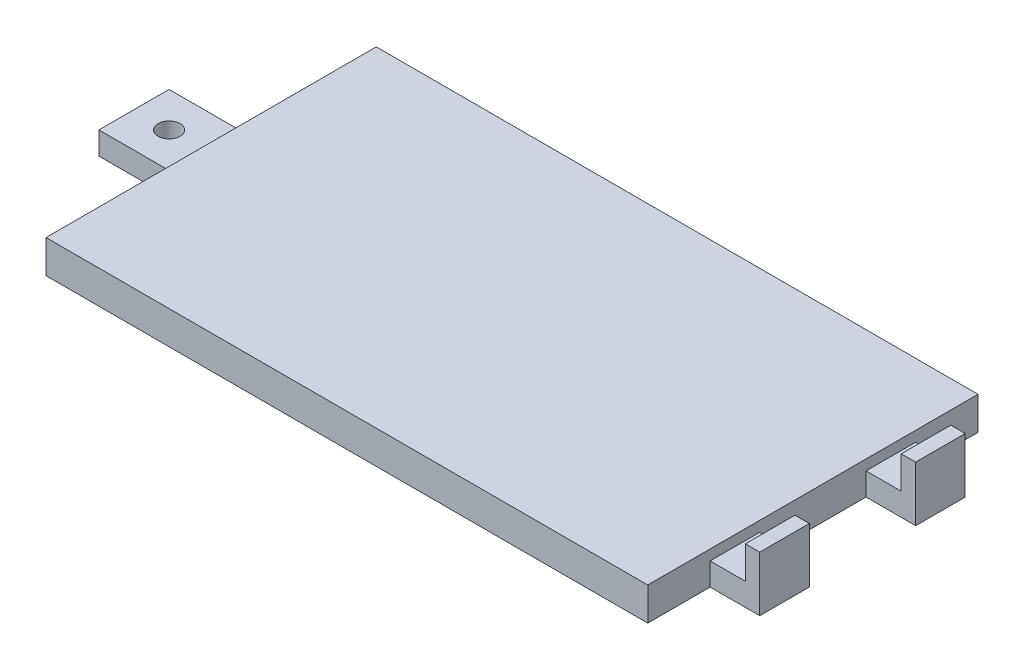
ISO-10303-21;
HEADER;
FILE_DESCRIPTION(('STEP AP214'),'2;1');
FILE_NAME('part.step','',(''),(''),'','','');
FILE_SCHEMA(('AUTOMOTIVE_DESIGN { 1 0 10303 214 1 1 1 1 }'));
ENDSEC;
DATA;
#1=APPLICATION_CONTEXT('core data for automotive mechanical design processes');
#2=APPLICATION_PROTOCOL_DEFINITION('international standard','automotive_design',2000,#1);
#3=PRODUCT_CONTEXT('',#1,'mechanical');
#4=PRODUCT('Part','Part','',(#3));
#5=PRODUCT_RELATED_PRODUCT_CATEGORY('part','',(#4));
#6=PRODUCT_DEFINITION_FORMATION('','',#4);
#7=PRODUCT_DEFINITION_CONTEXT('part definition',#1,'design');
#8=PRODUCT_DEFINITION('design','',#6,#7);
#9=PRODUCT_DEFINITION_SHAPE('','',#8);
#10=(LENGTH_UNIT() NAMED_UNIT(*) SI_UNIT(.MILLI.,.METRE.));
#11=(NAMED_UNIT(*) PLANE_ANGLE_UNIT() SI_UNIT($,.RADIAN.));
#12=(NAMED_UNIT(*) SI_UNIT($,.STERADIAN.) SOLID_ANGLE_UNIT());
#13=UNCERTAINTY_MEASURE_WITH_UNIT(LENGTH_MEASURE(1.E-05),#10,'distance_accuracy_value','');
#14=(GEOMETRIC_REPRESENTATION_CONTEXT(3) GLOBAL_UNCERTAINTY_ASSIGNED_CONTEXT((#13)) GLOBAL_UNIT_ASSIGNED_CONTEXT((#10,
#11,#12)) REPRESENTATION_CONTEXT('',''));
#15=CARTESIAN_POINT('',(0.,0.,0.));
#16=DIRECTION('',(0.,0.,1.));
#17=DIRECTION('',(1.,0.,0.));
#18=AXIS2_PLACEMENT_3D('',#15,#16,#17);
#19=CARTESIAN_POINT('',(-41.5511625644707,5.,-12.5287894458874));
#20=DIRECTION('',(0.,-1.,0.));
#21=DIRECTION('',(0.,0.,-1.));
#22=AXIS2_PLACEMENT_3D('',#19,#20,#21);
#23=CYLINDRICAL_SURFACE('',#22,0.999999999999998);
#24=CARTESIAN_POINT('',(-41.5511625644707,2.05857676607479,-12.5287894458874));
#25=DIRECTION('',(0.,-1.,0.));
#26=DIRECTION('',(0.,0.,-1.));
#27=AXIS2_PLACEMENT_3D('',#24,#25,#26);
#28=CIRCLE('',#27,0.999999999999998);
#29=CARTESIAN_POINT('',(-41.5511625644707,2.05857676607479,-13.5287894458874));
#30=VERTEX_POINT('',#29);
#31=EDGE_CURVE('E182',#30,#30,#28,.T.);
#32=ORIENTED_EDGE('',*,*,#31,.F.);
#33=EDGE_LOOP('',(#32));
#34=FACE_BOUND('',#33,.T.);
#35=CARTESIAN_POINT('',(-41.5511625644707,0.5,-12.5287894458874));
#36=DIRECTION('',(0.,-1.,0.));
#37=DIRECTION('',(0.,0.,-1.));
#38=AXIS2_PLACEMENT_3D('',#35,#36,#37);
#39=CIRCLE('',#38,0.999999999999998);
#40=CARTESIAN_POINT('',(-41.5511625644707,0.5,-13.5287894458874));
#41=VERTEX_POINT('',#40);
#42=EDGE_CURVE('E42',#41,#41,#39,.F.);
#43=ORIENTED_EDGE('',*,*,#42,.F.);
#44=EDGE_LOOP('',(#43));
#45=FACE_BOUND('',#44,.T.);
#46=ADVANCED_FACE('F38',(#34,#45),#23,.F.);
#47=CARTESIAN_POINT('',(0.,3.,0.));
#48=DIRECTION('',(0.,1.,0.));
#49=DIRECTION('',(0.,0.,1.));
#50=AXIS2_PLACEMENT_3D('',#47,#48,#49);
#51=PLANE('',#50);
#52=DIRECTION('',(1.,0.,0.));
#53=VECTOR('',#52,1.);
#54=CARTESIAN_POINT('',(0.,3.,2.45621055411259));
#55=LINE('',#54,#53);
#56=CARTESIAN_POINT('',(-37.7411625644707,3.,2.45621055411259));
#57=VERTEX_POINT('',#56);
#58=CARTESIAN_POINT('',(16.8688374355293,3.,2.45621055411259));
#59=VERTEX_POINT('',#58);
#60=EDGE_CURVE('E277',#57,#59,#55,.T.);
#61=ORIENTED_EDGE('',*,*,#60,.T.);
#62=DIRECTION('',(0.,0.,1.));
#63=VECTOR('',#62,1.);
#64=CARTESIAN_POINT('',(16.8688374355293,3.,0.));
#65=LINE('',#64,#63);
#66=CARTESIAN_POINT('',(16.8688374355293,3.,-27.5137894458874));
#67=VERTEX_POINT('',#66);
#68=EDGE_CURVE('E269',#67,#59,#65,.T.);
#69=ORIENTED_EDGE('',*,*,#68,.F.);
#70=DIRECTION('',(1.,0.,0.));
#71=VECTOR('',#70,1.);
#72=CARTESIAN_POINT('',(0.,3.,-27.5137894458874));
#73=LINE('',#72,#71);
#74=CARTESIAN_POINT('',(-37.7411625644707,3.,-27.5137894458874));
#75=VERTEX_POINT('',#74);
#76=EDGE_CURVE('E271',#75,#67,#73,.T.);
#77=ORIENTED_EDGE('',*,*,#76,.F.);
#78=DIRECTION('',(0.,0.,1.));
#79=VECTOR('',#78,1.);
#80=CARTESIAN_POINT('',(-37.7411625644707,3.,0.));
#81=LINE('',#80,#79);
#82=EDGE_CURVE('E275',#75,#57,#81,.T.);
#83=ORIENTED_EDGE('',*,*,#82,.T.);
#84=EDGE_LOOP('',(#61,#69,#77,#83));
#85=FACE_BOUND('',#84,.T.);
#86=ADVANCED_FACE('F394',(#85),#51,.T.);
#87=CARTESIAN_POINT('',(0.,3.,-27.5137894458874));
#88=DIRECTION('',(0.,0.,-1.));
#89=DIRECTION('',(-1.,0.,0.));
#90=AXIS2_PLACEMENT_3D('',#87,#88,#89);
#91=PLANE('',#90);
#92=DIRECTION('',(1.,0.,0.));
#93=VECTOR('',#92,1.);
#94=CARTESIAN_POINT('',(0.,0.,-27.5137894458874));
#95=LINE('',#94,#93);
#96=CARTESIAN_POINT('',(-37.7411625644707,0.,-27.5137894458874));
#97=VERTEX_POINT('',#96);
#98=CARTESIAN_POINT('',(16.8688374355293,0.,-27.5137894458874));
#99=VERTEX_POINT('',#98);
#100=EDGE_CURVE('E283',#97,#99,#95,.T.);
#101=ORIENTED_EDGE('',*,*,#100,.F.);
#102=DIRECTION('',(0.,-1.,0.));
#103=VECTOR('',#102,1.);
#104=CARTESIAN_POINT('',(-37.7411625644707,3.,-27.5137894458874));
#105=LINE('',#104,#103);
#106=EDGE_CURVE('E206',#75,#97,#105,.T.);
#107=ORIENTED_EDGE('',*,*,#106,.F.);
#108=ORIENTED_EDGE('',*,*,#76,.T.);
#109=DIRECTION('',(0.,-1.,0.));
#110=VECTOR('',#109,1.);
#111=CARTESIAN_POINT('',(16.8688374355293,3.,-27.5137894458874));
#112=LINE('',#111,#110);
#113=EDGE_CURVE('E208',#67,#99,#112,.T.);
#114=ORIENTED_EDGE('',*,*,#113,.T.);
#115=EDGE_LOOP('',(#101,#107,#108,#114));
#116=FACE_BOUND('',#115,.T.);
#117=ADVANCED_FACE('F40',(#116),#91,.T.);
#118=CARTESIAN_POINT('',(0.,3.,-15.7137894458874));
#119=DIRECTION('',(0.,0.,1.));
#120=DIRECTION('',(1.,0.,0.));
#121=AXIS2_PLACEMENT_3D('',#118,#119,#120);
#122=PLANE('',#121);
#123=DIRECTION('',(0.,-1.,0.));
#124=VECTOR('',#123,1.);
#125=CARTESIAN_POINT('',(-44.7411625644707,3.,-15.7137894458874));
#126=LINE('',#125,#124);
#127=CARTESIAN_POINT('',(-44.7411625644707,2.05857676607479,-15.7137894458874));
#128=VERTEX_POINT('',#127);
#129=CARTESIAN_POINT('',(-44.7411625644707,0.,-15.7137894458874));
#130=VERTEX_POINT('',#129);
#131=EDGE_CURVE('E197',#128,#130,#126,.T.);
#132=ORIENTED_EDGE('',*,*,#131,.F.);
#133=DIRECTION('',(-1.,0.,0.));
#134=VECTOR('',#133,1.);
#135=CARTESIAN_POINT('',(-44.7818956450625,2.05857676607479,-15.7137894458874));
#136=LINE('',#135,#134);
#137=CARTESIAN_POINT('',(-37.7411625644707,2.05857676607479,-15.7137894458874));
#138=VERTEX_POINT('',#137);
#139=EDGE_CURVE('E178',#138,#128,#136,.T.);
#140=ORIENTED_EDGE('',*,*,#139,.F.);
#141=DIRECTION('',(0.,-1.,0.));
#142=VECTOR('',#141,1.);
#143=CARTESIAN_POINT('',(-37.7411625644707,3.,-15.7137894458874));
#144=LINE('',#143,#142);
#145=CARTESIAN_POINT('',(-37.7411625644707,0.,-15.7137894458874));
#146=VERTEX_POINT('',#145);
#147=EDGE_CURVE('E199',#138,#146,#144,.T.);
#148=ORIENTED_EDGE('',*,*,#147,.T.);
#149=DIRECTION('',(-1.,0.,0.));
#150=VECTOR('',#149,1.);
#151=CARTESIAN_POINT('',(0.,0.,-15.7137894458874));
#152=LINE('',#151,#150);
#153=EDGE_CURVE('E291',#146,#130,#152,.T.);
#154=ORIENTED_EDGE('',*,*,#153,.T.);
#155=EDGE_LOOP('',(#132,#140,#148,#154));
#156=FACE_BOUND('',#155,.T.);
#157=ADVANCED_FACE('F436',(#156),#122,.F.);
#158=CARTESIAN_POINT('',(-44.7411625644707,3.,0.));
#159=DIRECTION('',(1.,0.,0.));
#160=DIRECTION('',(0.,0.,-1.));
#161=AXIS2_PLACEMENT_3D('',#158,#159,#160);
#162=PLANE('',#161);
#163=DIRECTION('',(0.,-1.,0.));
#164=VECTOR('',#163,1.);
#165=CARTESIAN_POINT('',(-44.7411625644707,3.,-9.34378944588741));
#166=LINE('',#165,#164);
#167=CARTESIAN_POINT('',(-44.7411625644707,2.05857676607479,-9.34378944588741));
#168=VERTEX_POINT('',#167);
#169=CARTESIAN_POINT('',(-44.7411625644707,0.,-9.34378944588741));
#170=VERTEX_POINT('',#169);
#171=EDGE_CURVE('E188',#168,#170,#166,.T.);
#172=ORIENTED_EDGE('',*,*,#171,.F.);
#173=DIRECTION('',(0.,0.,1.));
#174=VECTOR('',#173,1.);
#175=CARTESIAN_POINT('',(-44.7411625644707,2.05857676607479,-27.5147894458874));
#176=LINE('',#175,#174);
#177=EDGE_CURVE('E175',#128,#168,#176,.T.);
#178=ORIENTED_EDGE('',*,*,#177,.F.);
#179=ORIENTED_EDGE('',*,*,#131,.T.);
#180=DIRECTION('',(0.,0.,1.));
#181=VECTOR('',#180,1.);
#182=CARTESIAN_POINT('',(-44.7411625644707,0.,0.));
#183=LINE('',#182,#181);
#184=EDGE_CURVE('E195',#130,#170,#183,.T.);
#185=ORIENTED_EDGE('',*,*,#184,.T.);
#186=EDGE_LOOP('',(#172,#178,#179,#185));
#187=FACE_BOUND('',#186,.T.);
#188=ADVANCED_FACE('F193',(#187),#162,.F.);
#189=CARTESIAN_POINT('',(0.,3.,-9.34378944588742));
#190=DIRECTION('',(0.,0.,1.));
#191=DIRECTION('',(1.,0.,0.));
#192=AXIS2_PLACEMENT_3D('',#189,#190,#191);
#193=PLANE('',#192);
#194=DIRECTION('',(1.,0.,0.));
#195=VECTOR('',#194,1.);
#196=CARTESIAN_POINT('',(-44.7818956450625,2.05857676607479,-9.34378944588742));
#197=LINE('',#196,#195);
#198=CARTESIAN_POINT('',(-37.7411625644707,2.05857676607479,-9.34378944588741));
#199=VERTEX_POINT('',#198);
#200=EDGE_CURVE('E55',#168,#199,#197,.T.);
#201=ORIENTED_EDGE('',*,*,#200,.F.);
#202=ORIENTED_EDGE('',*,*,#171,.T.);
#203=DIRECTION('',(-1.,0.,0.));
#204=VECTOR('',#203,1.);
#205=CARTESIAN_POINT('',(0.,0.,-9.34378944588742));
#206=LINE('',#205,#204);
#207=CARTESIAN_POINT('',(-37.7411625644707,0.,-9.34378944588741));
#208=VERTEX_POINT('',#207);
#209=EDGE_CURVE('E296',#208,#170,#206,.T.);
#210=ORIENTED_EDGE('',*,*,#209,.F.);
#211=DIRECTION('',(0.,-1.,0.));
#212=VECTOR('',#211,1.);
#213=CARTESIAN_POINT('',(-37.7411625644707,3.,-9.34378944588741));
#214=LINE('',#213,#212);
#215=EDGE_CURVE('E190',#199,#208,#214,.T.);
#216=ORIENTED_EDGE('',*,*,#215,.F.);
#217=EDGE_LOOP('',(#201,#202,#210,#216));
#218=FACE_BOUND('',#217,.T.);
#219=ADVANCED_FACE('F186',(#218),#193,.T.);
#220=CARTESIAN_POINT('',(-37.7411625644707,3.,0.));
#221=DIRECTION('',(1.,0.,0.));
#222=DIRECTION('',(0.,0.,-1.));
#223=AXIS2_PLACEMENT_3D('',#220,#221,#222);
#224=PLANE('',#223);
#225=DIRECTION('',(0.,0.,1.));
#226=VECTOR('',#225,1.);
#227=CARTESIAN_POINT('',(-37.7411625644707,0.,0.));
#228=LINE('',#227,#226);
#229=CARTESIAN_POINT('',(-37.7411625644707,0.,2.45621055411259));
#230=VERTEX_POINT('',#229);
#231=EDGE_CURVE('E292',#208,#230,#228,.T.);
#232=ORIENTED_EDGE('',*,*,#231,.T.);
#233=DIRECTION('',(0.,-1.,0.));
#234=VECTOR('',#233,1.);
#235=CARTESIAN_POINT('',(-37.7411625644707,3.,2.45621055411259));
#236=LINE('',#235,#234);
#237=EDGE_CURVE('E201',#57,#230,#236,.T.);
#238=ORIENTED_EDGE('',*,*,#237,.F.);
#239=ORIENTED_EDGE('',*,*,#82,.F.);
#240=ORIENTED_EDGE('',*,*,#106,.T.);
#241=EDGE_CURVE('E288',#97,#146,#228,.T.);
#242=ORIENTED_EDGE('',*,*,#241,.T.);
#243=ORIENTED_EDGE('',*,*,#147,.F.);
#244=DIRECTION('',(0.,0.,1.));
#245=VECTOR('',#244,1.);
#246=CARTESIAN_POINT('',(-37.7411625644707,2.05857676607479,-27.5147894458874));
#247=LINE('',#246,#245);
#248=EDGE_CURVE('E191',#138,#199,#247,.T.);
#249=ORIENTED_EDGE('',*,*,#248,.T.);
#250=ORIENTED_EDGE('',*,*,#215,.T.);
#251=EDGE_LOOP('',(#232,#238,#239,#240,#242,#243,#249,#250));
#252=FACE_BOUND('',#251,.T.);
#253=ADVANCED_FACE('F433',(#252),#224,.F.);
#254=CARTESIAN_POINT('',(0.,3.,2.45621055411259));
#255=DIRECTION('',(0.,0.,-1.));
#256=DIRECTION('',(-1.,0.,0.));
#257=AXIS2_PLACEMENT_3D('',#254,#255,#256);
#258=PLANE('',#257);
#259=DIRECTION('',(1.,0.,0.));
#260=VECTOR('',#259,1.);
#261=CARTESIAN_POINT('',(0.,0.,2.45621055411259));
#262=LINE('',#261,#260);
#263=CARTESIAN_POINT('',(16.8688374355293,0.,2.45621055411259));
#264=VERTEX_POINT('',#263);
#265=EDGE_CURVE('E298',#230,#264,#262,.T.);
#266=ORIENTED_EDGE('',*,*,#265,.T.);
#267=DIRECTION('',(0.,-1.,0.));
#268=VECTOR('',#267,1.);
#269=CARTESIAN_POINT('',(16.8688374355293,3.,2.45621055411259));
#270=LINE('',#269,#268);
#271=EDGE_CURVE('E333',#59,#264,#270,.T.);
#272=ORIENTED_EDGE('',*,*,#271,.F.);
#273=ORIENTED_EDGE('',*,*,#60,.F.);
#274=ORIENTED_EDGE('',*,*,#237,.T.);
#275=EDGE_LOOP('',(#266,#272,#273,#274));
#276=FACE_BOUND('',#275,.T.);
#277=ADVANCED_FACE('F339',(#276),#258,.F.);
#278=CARTESIAN_POINT('',(0.,3.,-3.20378944588741));
#279=DIRECTION('',(0.,0.,-1.));
#280=DIRECTION('',(-1.,0.,0.));
#281=AXIS2_PLACEMENT_3D('',#278,#279,#280);
#282=PLANE('',#281);
#283=DIRECTION('',(1.,0.,0.));
#284=VECTOR('',#283,1.);
#285=CARTESIAN_POINT('',(16.8688374355293,5.,-3.20378944588741));
#286=LINE('',#285,#284);
#287=CARTESIAN_POINT('',(20.062747165678,5.,-3.20378944588741));
#288=VERTEX_POINT('',#287);
#289=CARTESIAN_POINT('',(21.3688374355293,5.,-3.20378944588741));
#290=VERTEX_POINT('',#289);
#291=EDGE_CURVE('E252',#288,#290,#286,.T.);
#292=ORIENTED_EDGE('',*,*,#291,.F.);
#293=DIRECTION('',(0.,-1.,0.));
#294=VECTOR('',#293,1.);
#295=CARTESIAN_POINT('',(20.062747165678,3.,-3.20378944588741));
#296=LINE('',#295,#294);
#297=CARTESIAN_POINT('',(20.062747165678,2.06,-3.20378944588742));
#298=VERTEX_POINT('',#297);
#299=EDGE_CURVE('E241',#288,#298,#296,.T.);
#300=ORIENTED_EDGE('',*,*,#299,.T.);
#301=DIRECTION('',(-1.,0.,0.));
#302=VECTOR('',#301,1.);
#303=CARTESIAN_POINT('',(0.,2.06,-3.20378944588741));
#304=LINE('',#303,#302);
#305=CARTESIAN_POINT('',(16.8688374355293,2.06,-3.20378944588742));
#306=VERTEX_POINT('',#305);
#307=EDGE_CURVE('E249',#298,#306,#304,.T.);
#308=ORIENTED_EDGE('',*,*,#307,.T.);
#309=DIRECTION('',(0.,-1.,0.));
#310=VECTOR('',#309,1.);
#311=CARTESIAN_POINT('',(16.8688374355293,3.,-3.20378944588741));
#312=LINE('',#311,#310);
#313=CARTESIAN_POINT('',(16.8688374355293,0.,-3.20378944588741));
#314=VERTEX_POINT('',#313);
#315=EDGE_CURVE('E331',#306,#314,#312,.T.);
#316=ORIENTED_EDGE('',*,*,#315,.T.);
#317=DIRECTION('',(1.,0.,0.));
#318=VECTOR('',#317,1.);
#319=CARTESIAN_POINT('',(0.,0.,-3.20378944588741));
#320=LINE('',#319,#318);
#321=CARTESIAN_POINT('',(21.3688374355293,0.,-3.20378944588741));
#322=VERTEX_POINT('',#321);
#323=EDGE_CURVE('E301',#314,#322,#320,.T.);
#324=ORIENTED_EDGE('',*,*,#323,.T.);
#325=DIRECTION('',(0.,-1.,0.));
#326=VECTOR('',#325,1.);
#327=CARTESIAN_POINT('',(21.3688374355293,3.,-3.20378944588741));
#328=LINE('',#327,#326);
#329=EDGE_CURVE('E329',#290,#322,#328,.T.);
#330=ORIENTED_EDGE('',*,*,#329,.F.);
#331=EDGE_LOOP('',(#292,#300,#308,#316,#324,#330));
#332=FACE_BOUND('',#331,.T.);
#333=ADVANCED_FACE('F372',(#332),#282,.F.);
#334=CARTESIAN_POINT('',(21.3688374355293,3.,0.));
#335=DIRECTION('',(1.,0.,0.));
#336=DIRECTION('',(0.,0.,-1.));
#337=AXIS2_PLACEMENT_3D('',#334,#335,#336);
#338=PLANE('',#337);
#339=DIRECTION('',(0.,0.,1.));
#340=VECTOR('',#339,1.);
#341=CARTESIAN_POINT('',(21.3688374355293,0.,0.));
#342=LINE('',#341,#340);
#343=CARTESIAN_POINT('',(21.3688374355293,0.,-7.70378944588741));
#344=VERTEX_POINT('',#343);
#345=EDGE_CURVE('E304',#344,#322,#342,.T.);
#346=ORIENTED_EDGE('',*,*,#345,.F.);
#347=DIRECTION('',(0.,-1.,0.));
#348=VECTOR('',#347,1.);
#349=CARTESIAN_POINT('',(21.3688374355293,3.,-7.70378944588741));
#350=LINE('',#349,#348);
#351=CARTESIAN_POINT('',(21.3688374355293,5.,-7.70378944588741));
#352=VERTEX_POINT('',#351);
#353=EDGE_CURVE('E327',#352,#344,#350,.T.);
#354=ORIENTED_EDGE('',*,*,#353,.F.);
#355=DIRECTION('',(0.,0.,-1.));
#356=VECTOR('',#355,1.);
#357=CARTESIAN_POINT('',(21.3688374355293,5.,-7.70378944588741));
#358=LINE('',#357,#356);
#359=EDGE_CURVE('E254',#290,#352,#358,.T.);
#360=ORIENTED_EDGE('',*,*,#359,.F.);
#361=ORIENTED_EDGE('',*,*,#329,.T.);
#362=EDGE_LOOP('',(#346,#354,#360,#361));
#363=FACE_BOUND('',#362,.T.);
#364=ADVANCED_FACE('F368',(#363),#338,.T.);
#365=CARTESIAN_POINT('',(0.,3.,-7.70378944588741));
#366=DIRECTION('',(0.,0.,-1.));
#367=DIRECTION('',(-1.,0.,0.));
#368=AXIS2_PLACEMENT_3D('',#365,#366,#367);
#369=PLANE('',#368);
#370=DIRECTION('',(0.,-1.,0.));
#371=VECTOR('',#370,1.);
#372=CARTESIAN_POINT('',(20.062747165678,3.,-7.70378944588741));
#373=LINE('',#372,#371);
#374=CARTESIAN_POINT('',(20.062747165678,5.,-7.70378944588741));
#375=VERTEX_POINT('',#374);
#376=CARTESIAN_POINT('',(20.062747165678,2.06,-7.70378944588741));
#377=VERTEX_POINT('',#376);
#378=EDGE_CURVE('E239',#375,#377,#373,.T.);
#379=ORIENTED_EDGE('',*,*,#378,.F.);
#380=DIRECTION('',(-1.,0.,0.));
#381=VECTOR('',#380,1.);
#382=CARTESIAN_POINT('',(16.8688374355293,5.,-7.70378944588741));
#383=LINE('',#382,#381);
#384=EDGE_CURVE('E257',#352,#375,#383,.T.);
#385=ORIENTED_EDGE('',*,*,#384,.F.);
#386=ORIENTED_EDGE('',*,*,#353,.T.);
#387=DIRECTION('',(1.,0.,0.));
#388=VECTOR('',#387,1.);
#389=CARTESIAN_POINT('',(0.,0.,-7.70378944588741));
#390=LINE('',#389,#388);
#391=CARTESIAN_POINT('',(16.8688374355293,0.,-7.70378944588741));
#392=VERTEX_POINT('',#391);
#393=EDGE_CURVE('E307',#392,#344,#390,.T.);
#394=ORIENTED_EDGE('',*,*,#393,.F.);
#395=DIRECTION('',(0.,-1.,0.));
#396=VECTOR('',#395,1.);
#397=CARTESIAN_POINT('',(16.8688374355293,3.,-7.70378944588741));
#398=LINE('',#397,#396);
#399=CARTESIAN_POINT('',(16.8688374355293,2.06,-7.70378944588741));
#400=VERTEX_POINT('',#399);
#401=EDGE_CURVE('E325',#400,#392,#398,.T.);
#402=ORIENTED_EDGE('',*,*,#401,.F.);
#403=DIRECTION('',(-1.,0.,0.));
#404=VECTOR('',#403,1.);
#405=CARTESIAN_POINT('',(0.,2.06,-7.70378944588741));
#406=LINE('',#405,#404);
#407=EDGE_CURVE('E247',#377,#400,#406,.T.);
#408=ORIENTED_EDGE('',*,*,#407,.F.);
#409=EDGE_LOOP('',(#379,#385,#386,#394,#402,#408));
#410=FACE_BOUND('',#409,.T.);
#411=ADVANCED_FACE('F363',(#410),#369,.T.);
#412=CARTESIAN_POINT('',(16.8688374355293,3.,0.));
#413=DIRECTION('',(1.,0.,0.));
#414=DIRECTION('',(0.,0.,-1.));
#415=AXIS2_PLACEMENT_3D('',#412,#413,#414);
#416=PLANE('',#415);
#417=DIRECTION('',(0.,-1.,0.));
#418=VECTOR('',#417,1.);
#419=CARTESIAN_POINT('',(16.8688374355293,3.,-17.3537894458874));
#420=LINE('',#419,#418);
#421=CARTESIAN_POINT('',(16.8688374355293,2.06,-17.3537894458874));
#422=VERTEX_POINT('',#421);
#423=CARTESIAN_POINT('',(16.8688374355293,0.,-17.3537894458874));
#424=VERTEX_POINT('',#423);
#425=EDGE_CURVE('E323',#422,#424,#420,.T.);
#426=ORIENTED_EDGE('',*,*,#425,.F.);
#427=DIRECTION('',(0.,0.,1.));
#428=VECTOR('',#427,1.);
#429=CARTESIAN_POINT('',(16.8688374355293,2.06,-27.5137894458874));
#430=LINE('',#429,#428);
#431=CARTESIAN_POINT('',(16.8688374355293,2.06,-21.8537894458874));
#432=VERTEX_POINT('',#431);
#433=EDGE_CURVE('E235',#432,#422,#430,.T.);
#434=ORIENTED_EDGE('',*,*,#433,.F.);
#435=DIRECTION('',(0.,-1.,0.));
#436=VECTOR('',#435,1.);
#437=CARTESIAN_POINT('',(16.8688374355293,3.,-21.8537894458874));
#438=LINE('',#437,#436);
#439=CARTESIAN_POINT('',(16.8688374355293,0.,-21.8537894458874));
#440=VERTEX_POINT('',#439);
#441=EDGE_CURVE('E280',#432,#440,#438,.T.);
#442=ORIENTED_EDGE('',*,*,#441,.T.);
#443=DIRECTION('',(0.,0.,1.));
#444=VECTOR('',#443,1.);
#445=CARTESIAN_POINT('',(16.8688374355293,0.,0.));
#446=LINE('',#445,#444);
#447=EDGE_CURVE('E268',#99,#440,#446,.T.);
#448=ORIENTED_EDGE('',*,*,#447,.F.);
#449=ORIENTED_EDGE('',*,*,#113,.F.);
#450=ORIENTED_EDGE('',*,*,#68,.T.);
#451=ORIENTED_EDGE('',*,*,#271,.T.);
#452=EDGE_CURVE('E285',#314,#264,#446,.T.);
#453=ORIENTED_EDGE('',*,*,#452,.F.);
#454=ORIENTED_EDGE('',*,*,#315,.F.);
#455=EDGE_CURVE('E227',#400,#306,#430,.T.);
#456=ORIENTED_EDGE('',*,*,#455,.F.);
#457=ORIENTED_EDGE('',*,*,#401,.T.);
#458=EDGE_CURVE('E284',#424,#392,#446,.T.);
#459=ORIENTED_EDGE('',*,*,#458,.F.);
#460=EDGE_LOOP('',(#426,#434,#442,#448,#449,#450,#451,#453,#454,#456,#457,#459));
#461=FACE_BOUND('',#460,.T.);
#462=ADVANCED_FACE('F356',(#461),#416,.T.);
#463=CARTESIAN_POINT('',(0.,3.,-17.3537894458874));
#464=DIRECTION('',(0.,0.,-1.));
#465=DIRECTION('',(-1.,0.,0.));
#466=AXIS2_PLACEMENT_3D('',#463,#464,#465);
#467=PLANE('',#466);
#468=DIRECTION('',(1.,0.,0.));
#469=VECTOR('',#468,1.);
#470=CARTESIAN_POINT('',(16.8688374355293,5.,-17.3537894458874));
#471=LINE('',#470,#469);
#472=CARTESIAN_POINT('',(20.062747165678,5.,-17.3537894458874));
#473=VERTEX_POINT('',#472);
#474=CARTESIAN_POINT('',(21.3688374355293,5.,-17.3537894458874));
#475=VERTEX_POINT('',#474);
#476=EDGE_CURVE('E260',#473,#475,#471,.T.);
#477=ORIENTED_EDGE('',*,*,#476,.F.);
#478=DIRECTION('',(0.,-1.,0.));
#479=VECTOR('',#478,1.);
#480=CARTESIAN_POINT('',(20.062747165678,3.,-17.3537894458874));
#481=LINE('',#480,#479);
#482=CARTESIAN_POINT('',(20.062747165678,2.06,-17.3537894458874));
#483=VERTEX_POINT('',#482);
#484=EDGE_CURVE('E63',#473,#483,#481,.T.);
#485=ORIENTED_EDGE('',*,*,#484,.T.);
#486=DIRECTION('',(-1.,0.,0.));
#487=VECTOR('',#486,1.);
#488=CARTESIAN_POINT('',(0.,2.06,-17.3537894458874));
#489=LINE('',#488,#487);
#490=EDGE_CURVE('E244',#483,#422,#489,.T.);
#491=ORIENTED_EDGE('',*,*,#490,.T.);
#492=ORIENTED_EDGE('',*,*,#425,.T.);
#493=DIRECTION('',(1.,0.,0.));
#494=VECTOR('',#493,1.);
#495=CARTESIAN_POINT('',(0.,0.,-17.3537894458874));
#496=LINE('',#495,#494);
#497=CARTESIAN_POINT('',(21.3688374355293,0.,-17.3537894458874));
#498=VERTEX_POINT('',#497);
#499=EDGE_CURVE('E310',#424,#498,#496,.T.);
#500=ORIENTED_EDGE('',*,*,#499,.T.);
#501=DIRECTION('',(0.,-1.,0.));
#502=VECTOR('',#501,1.);
#503=CARTESIAN_POINT('',(21.3688374355293,3.,-17.3537894458874));
#504=LINE('',#503,#502);
#505=EDGE_CURVE('E321',#475,#498,#504,.T.);
#506=ORIENTED_EDGE('',*,*,#505,.F.);
#507=EDGE_LOOP('',(#477,#485,#491,#492,#500,#506));
#508=FACE_BOUND('',#507,.T.);
#509=ADVANCED_FACE('F458',(#508),#467,.F.);
#510=CARTESIAN_POINT('',(21.3688374355293,3.,0.));
#511=DIRECTION('',(1.,0.,0.));
#512=DIRECTION('',(0.,0.,-1.));
#513=AXIS2_PLACEMENT_3D('',#510,#511,#512);
#514=PLANE('',#513);
#515=DIRECTION('',(0.,0.,1.));
#516=VECTOR('',#515,1.);
#517=CARTESIAN_POINT('',(21.3688374355293,0.,0.));
#518=LINE('',#517,#516);
#519=CARTESIAN_POINT('',(21.3688374355293,0.,-21.8537894458874));
#520=VERTEX_POINT('',#519);
#521=EDGE_CURVE('E313',#520,#498,#518,.T.);
#522=ORIENTED_EDGE('',*,*,#521,.F.);
#523=DIRECTION('',(0.,-1.,0.));
#524=VECTOR('',#523,1.);
#525=CARTESIAN_POINT('',(21.3688374355293,3.,-21.8537894458874));
#526=LINE('',#525,#524);
#527=CARTESIAN_POINT('',(21.3688374355293,5.,-21.8537894458874));
#528=VERTEX_POINT('',#527);
#529=EDGE_CURVE('E319',#528,#520,#526,.T.);
#530=ORIENTED_EDGE('',*,*,#529,.F.);
#531=DIRECTION('',(0.,0.,-1.));
#532=VECTOR('',#531,1.);
#533=CARTESIAN_POINT('',(21.3688374355293,5.,-21.8537894458874));
#534=LINE('',#533,#532);
#535=EDGE_CURVE('E262',#475,#528,#534,.T.);
#536=ORIENTED_EDGE('',*,*,#535,.F.);
#537=ORIENTED_EDGE('',*,*,#505,.T.);
#538=EDGE_LOOP('',(#522,#530,#536,#537));
#539=FACE_BOUND('',#538,.T.);
#540=ADVANCED_FACE('F461',(#539),#514,.T.);
#541=CARTESIAN_POINT('',(0.,3.,-21.8537894458874));
#542=DIRECTION('',(0.,0.,-1.));
#543=DIRECTION('',(-1.,0.,0.));
#544=AXIS2_PLACEMENT_3D('',#541,#542,#543);
#545=PLANE('',#544);
#546=DIRECTION('',(0.,-1.,0.));
#547=VECTOR('',#546,1.);
#548=CARTESIAN_POINT('',(20.062747165678,3.,-21.8537894458874));
#549=LINE('',#548,#547);
#550=CARTESIAN_POINT('',(20.062747165678,5.,-21.8537894458874));
#551=VERTEX_POINT('',#550);
#552=CARTESIAN_POINT('',(20.062747165678,2.06,-21.8537894458874));
#553=VERTEX_POINT('',#552);
#554=EDGE_CURVE('E230',#551,#553,#549,.T.);
#555=ORIENTED_EDGE('',*,*,#554,.F.);
#556=DIRECTION('',(-1.,0.,0.));
#557=VECTOR('',#556,1.);
#558=CARTESIAN_POINT('',(16.8688374355293,5.,-21.8537894458874));
#559=LINE('',#558,#557);
#560=EDGE_CURVE('E265',#528,#551,#559,.T.);
#561=ORIENTED_EDGE('',*,*,#560,.F.);
#562=ORIENTED_EDGE('',*,*,#529,.T.);
#563=DIRECTION('',(1.,0.,0.));
#564=VECTOR('',#563,1.);
#565=CARTESIAN_POINT('',(0.,0.,-21.8537894458874));
#566=LINE('',#565,#564);
#567=EDGE_CURVE('E272',#440,#520,#566,.T.);
#568=ORIENTED_EDGE('',*,*,#567,.F.);
#569=ORIENTED_EDGE('',*,*,#441,.F.);
#570=DIRECTION('',(-1.,0.,0.));
#571=VECTOR('',#570,1.);
#572=CARTESIAN_POINT('',(0.,2.06,-21.8537894458874));
#573=LINE('',#572,#571);
#574=EDGE_CURVE('E11',#553,#432,#573,.T.);
#575=ORIENTED_EDGE('',*,*,#574,.F.);
#576=EDGE_LOOP('',(#555,#561,#562,#568,#569,#575));
#577=FACE_BOUND('',#576,.T.);
#578=ADVANCED_FACE('F423',(#577),#545,.T.);
#579=CARTESIAN_POINT('',(0.,0.,0.));
#580=DIRECTION('',(0.,1.,0.));
#581=DIRECTION('',(0.,0.,1.));
#582=AXIS2_PLACEMENT_3D('',#579,#580,#581);
#583=PLANE('',#582);
#584=CARTESIAN_POINT('',(-41.5511625644707,0.,-12.5287894458874));
#585=DIRECTION('',(0.,-1.,0.));
#586=DIRECTION('',(0.,0.,-1.));
#587=AXIS2_PLACEMENT_3D('',#584,#585,#586);
#588=CIRCLE('',#587,1.25);
#589=CARTESIAN_POINT('',(-41.5511625644707,0.,-13.7787894458874));
#590=VERTEX_POINT('',#589);
#591=EDGE_CURVE('E218',#590,#590,#588,.T.);
#592=ORIENTED_EDGE('',*,*,#591,.F.);
#593=EDGE_LOOP('',(#592));
#594=FACE_BOUND('',#593,.T.);
#595=ORIENTED_EDGE('',*,*,#447,.T.);
#596=ORIENTED_EDGE('',*,*,#567,.T.);
#597=ORIENTED_EDGE('',*,*,#521,.T.);
#598=ORIENTED_EDGE('',*,*,#499,.F.);
#599=ORIENTED_EDGE('',*,*,#458,.T.);
#600=ORIENTED_EDGE('',*,*,#393,.T.);
#601=ORIENTED_EDGE('',*,*,#345,.T.);
#602=ORIENTED_EDGE('',*,*,#323,.F.);
#603=ORIENTED_EDGE('',*,*,#452,.T.);
#604=ORIENTED_EDGE('',*,*,#265,.F.);
#605=ORIENTED_EDGE('',*,*,#231,.F.);
#606=ORIENTED_EDGE('',*,*,#209,.T.);
#607=ORIENTED_EDGE('',*,*,#184,.F.);
#608=ORIENTED_EDGE('',*,*,#153,.F.);
#609=ORIENTED_EDGE('',*,*,#241,.F.);
#610=ORIENTED_EDGE('',*,*,#100,.T.);
#611=EDGE_LOOP('',(#595,#596,#597,#598,#599,#600,#601,#602,#603,#604,#605,#606,#607,#608,#609,#610));
#612=FACE_BOUND('',#611,.T.);
#613=ADVANCED_FACE('F346',(#594,#612),#583,.F.);
#614=CARTESIAN_POINT('',(0.,5.,0.));
#615=DIRECTION('',(0.,1.,0.));
#616=DIRECTION('',(0.,0.,1.));
#617=AXIS2_PLACEMENT_3D('',#614,#615,#616);
#618=PLANE('',#617);
#619=DIRECTION('',(0.,0.,1.));
#620=VECTOR('',#619,1.);
#621=CARTESIAN_POINT('',(20.062747165678,5.,-27.5137894458874));
#622=LINE('',#621,#620);
#623=EDGE_CURVE('E228',#551,#473,#622,.T.);
#624=ORIENTED_EDGE('',*,*,#623,.T.);
#625=ORIENTED_EDGE('',*,*,#476,.T.);
#626=ORIENTED_EDGE('',*,*,#535,.T.);
#627=ORIENTED_EDGE('',*,*,#560,.T.);
#628=EDGE_LOOP('',(#624,#625,#626,#627));
#629=FACE_BOUND('',#628,.T.);
#630=ADVANCED_FACE('F382',(#629),#618,.T.);
#631=CARTESIAN_POINT('',(0.,5.,0.));
#632=DIRECTION('',(0.,1.,0.));
#633=DIRECTION('',(0.,0.,1.));
#634=AXIS2_PLACEMENT_3D('',#631,#632,#633);
#635=PLANE('',#634);
#636=DIRECTION('',(0.,0.,-1.));
#637=VECTOR('',#636,1.);
#638=CARTESIAN_POINT('',(20.062747165678,5.,0.));
#639=LINE('',#638,#637);
#640=EDGE_CURVE('E47',#288,#375,#639,.T.);
#641=ORIENTED_EDGE('',*,*,#640,.F.);
#642=ORIENTED_EDGE('',*,*,#291,.T.);
#643=ORIENTED_EDGE('',*,*,#359,.T.);
#644=ORIENTED_EDGE('',*,*,#384,.T.);
#645=EDGE_LOOP('',(#641,#642,#643,#644));
#646=FACE_BOUND('',#645,.T.);
#647=ADVANCED_FACE('F380',(#646),#635,.T.);
#648=CARTESIAN_POINT('',(20.062747165678,5.,-27.5137894458874));
#649=DIRECTION('',(1.,0.,0.));
#650=DIRECTION('',(0.,0.,-1.));
#651=AXIS2_PLACEMENT_3D('',#648,#649,#650);
#652=PLANE('',#651);
#653=ORIENTED_EDGE('',*,*,#640,.T.);
#654=ORIENTED_EDGE('',*,*,#378,.T.);
#655=DIRECTION('',(0.,0.,1.));
#656=VECTOR('',#655,1.);
#657=CARTESIAN_POINT('',(20.062747165678,2.06,-27.5137894458874));
#658=LINE('',#657,#656);
#659=EDGE_CURVE('E232',#377,#298,#658,.T.);
#660=ORIENTED_EDGE('',*,*,#659,.T.);
#661=ORIENTED_EDGE('',*,*,#299,.F.);
#662=EDGE_LOOP('',(#653,#654,#660,#661));
#663=FACE_BOUND('',#662,.T.);
#664=ADVANCED_FACE('F377',(#663),#652,.F.);
#665=CARTESIAN_POINT('',(16.8688374355293,2.06,-27.5137894458874));
#666=DIRECTION('',(0.,-1.,0.));
#667=DIRECTION('',(0.,0.,-1.));
#668=AXIS2_PLACEMENT_3D('',#665,#666,#667);
#669=PLANE('',#668);
#670=ORIENTED_EDGE('',*,*,#659,.F.);
#671=ORIENTED_EDGE('',*,*,#407,.T.);
#672=ORIENTED_EDGE('',*,*,#455,.T.);
#673=ORIENTED_EDGE('',*,*,#307,.F.);
#674=EDGE_LOOP('',(#670,#671,#672,#673));
#675=FACE_BOUND('',#674,.T.);
#676=ADVANCED_FACE('F375',(#675),#669,.F.);
#677=EDGE_CURVE('E231',#553,#483,#658,.T.);
#678=ORIENTED_EDGE('',*,*,#677,.F.);
#679=ORIENTED_EDGE('',*,*,#574,.T.);
#680=ORIENTED_EDGE('',*,*,#433,.T.);
#681=ORIENTED_EDGE('',*,*,#490,.F.);
#682=EDGE_LOOP('',(#678,#679,#680,#681));
#683=FACE_BOUND('',#682,.T.);
#684=ADVANCED_FACE('F410',(#683),#669,.F.);
#685=ORIENTED_EDGE('',*,*,#623,.F.);
#686=ORIENTED_EDGE('',*,*,#554,.T.);
#687=ORIENTED_EDGE('',*,*,#677,.T.);
#688=ORIENTED_EDGE('',*,*,#484,.F.);
#689=EDGE_LOOP('',(#685,#686,#687,#688));
#690=FACE_BOUND('',#689,.T.);
#691=ADVANCED_FACE('F389',(#690),#652,.F.);
#692=CARTESIAN_POINT('',(-44.7818956450625,2.05857676607479,-27.5147894458874));
#693=DIRECTION('',(0.,-1.,0.));
#694=DIRECTION('',(0.,0.,-1.));
#695=AXIS2_PLACEMENT_3D('',#692,#693,#694);
#696=PLANE('',#695);
#697=ORIENTED_EDGE('',*,*,#31,.T.);
#698=EDGE_LOOP('',(#697));
#699=FACE_BOUND('',#698,.T.);
#700=ORIENTED_EDGE('',*,*,#139,.T.);
#701=ORIENTED_EDGE('',*,*,#177,.T.);
#702=ORIENTED_EDGE('',*,*,#200,.T.);
#703=ORIENTED_EDGE('',*,*,#248,.F.);
#704=EDGE_LOOP('',(#700,#701,#702,#703));
#705=FACE_BOUND('',#704,.T.);
#706=ADVANCED_FACE('F176',(#699,#705),#696,.F.);
#707=CARTESIAN_POINT('',(-41.5511625644707,0.5,-12.5287894458874));
#708=DIRECTION('',(0.,-1.,0.));
#709=DIRECTION('',(0.,0.,-1.));
#710=AXIS2_PLACEMENT_3D('',#707,#708,#709);
#711=PLANE('',#710);
#712=CARTESIAN_POINT('',(-41.5511625644707,0.5,-12.5287894458874));
#713=DIRECTION('',(0.,-1.,0.));
#714=DIRECTION('',(0.,0.,-1.));
#715=AXIS2_PLACEMENT_3D('',#712,#713,#714);
#716=CIRCLE('',#715,1.25);
#717=CARTESIAN_POINT('',(-41.5511625644707,0.5,-13.7787894458874));
#718=VERTEX_POINT('',#717);
#719=EDGE_CURVE('E214',#718,#718,#716,.T.);
#720=ORIENTED_EDGE('',*,*,#719,.T.);
#721=EDGE_LOOP('',(#720));
#722=FACE_BOUND('',#721,.T.);
#723=ORIENTED_EDGE('',*,*,#42,.T.);
#724=EDGE_LOOP('',(#723));
#725=FACE_BOUND('',#724,.T.);
#726=ADVANCED_FACE('F408',(#722,#725),#711,.T.);
#727=CARTESIAN_POINT('',(-41.5511625644707,0.5,-12.5287894458874));
#728=DIRECTION('',(0.,-1.,0.));
#729=DIRECTION('',(0.,0.,-1.));
#730=AXIS2_PLACEMENT_3D('',#727,#728,#729);
#731=CYLINDRICAL_SURFACE('',#730,1.25);
#732=ORIENTED_EDGE('',*,*,#719,.F.);
#733=EDGE_LOOP('',(#732));
#734=FACE_BOUND('',#733,.T.);
#735=ORIENTED_EDGE('',*,*,#591,.T.);
#736=EDGE_LOOP('',(#735));
#737=FACE_BOUND('',#736,.T.);
#738=ADVANCED_FACE('F405',(#734,#737),#731,.F.);
#739=CLOSED_SHELL('',(#46,#86,#117,#157,#188,#219,#253,#277,#333,#364,#411,#462,#509,#540,#578,
#613,#630,#647,#664,#676,#684,#691,#706,#726,#738));
#740=MANIFOLD_SOLID_BREP('B2',#739);
#741=ADVANCED_BREP_SHAPE_REPRESENTATION('',(#18,#740),#14);
#742=SHAPE_DEFINITION_REPRESENTATION(#9,#741);
ENDSEC;
END-ISO-10303-21;
